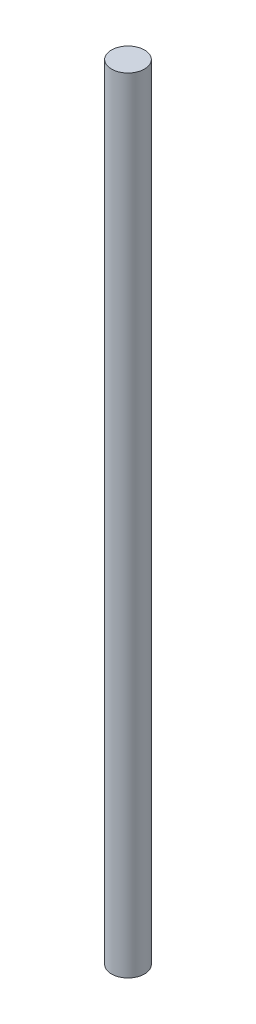
ISO-10303-21;
HEADER;
FILE_DESCRIPTION(('STEP AP214'),'2;1');
FILE_NAME('part.step','',(''),(''),'','','');
FILE_SCHEMA(('AUTOMOTIVE_DESIGN { 1 0 10303 214 1 1 1 1 }'));
ENDSEC;
DATA;
#1=APPLICATION_CONTEXT('core data for automotive mechanical design processes');
#2=APPLICATION_PROTOCOL_DEFINITION('international standard','automotive_design',2000,#1);
#3=PRODUCT_CONTEXT('',#1,'mechanical');
#4=PRODUCT('Part','Part','',(#3));
#5=PRODUCT_RELATED_PRODUCT_CATEGORY('part','',(#4));
#6=PRODUCT_DEFINITION_FORMATION('','',#4);
#7=PRODUCT_DEFINITION_CONTEXT('part definition',#1,'design');
#8=PRODUCT_DEFINITION('design','',#6,#7);
#9=PRODUCT_DEFINITION_SHAPE('','',#8);
#10=(LENGTH_UNIT() NAMED_UNIT(*) SI_UNIT(.MILLI.,.METRE.));
#11=(NAMED_UNIT(*) PLANE_ANGLE_UNIT() SI_UNIT($,.RADIAN.));
#12=(NAMED_UNIT(*) SI_UNIT($,.STERADIAN.) SOLID_ANGLE_UNIT());
#13=UNCERTAINTY_MEASURE_WITH_UNIT(LENGTH_MEASURE(1.E-05),#10,'distance_accuracy_value','');
#14=(GEOMETRIC_REPRESENTATION_CONTEXT(3) GLOBAL_UNCERTAINTY_ASSIGNED_CONTEXT((#13)) GLOBAL_UNIT_ASSIGNED_CONTEXT((#10,
#11,#12)) REPRESENTATION_CONTEXT('',''));
#15=CARTESIAN_POINT('',(0.,0.,0.));
#16=DIRECTION('',(0.,0.,1.));
#17=DIRECTION('',(1.,0.,0.));
#18=AXIS2_PLACEMENT_3D('',#15,#16,#17);
#19=CARTESIAN_POINT('',(0.,69.85,0.));
#20=DIRECTION('',(0.,-1.,0.));
#21=DIRECTION('',(0.,0.,-1.));
#22=AXIS2_PLACEMENT_3D('',#19,#20,#21);
#23=CYLINDRICAL_SURFACE('',#22,1.4732);
#24=CARTESIAN_POINT('',(0.,69.85,0.));
#25=DIRECTION('',(0.,1.,0.));
#26=DIRECTION('',(0.,0.,1.));
#27=AXIS2_PLACEMENT_3D('',#24,#25,#26);
#28=CIRCLE('',#27,1.4732);
#29=CARTESIAN_POINT('',(0.,69.85,1.4732));
#30=VERTEX_POINT('',#29);
#31=EDGE_CURVE('E10',#30,#30,#28,.T.);
#32=ORIENTED_EDGE('',*,*,#31,.F.);
#33=EDGE_LOOP('',(#32));
#34=FACE_BOUND('',#33,.T.);
#35=CARTESIAN_POINT('',(0.,0.,0.));
#36=DIRECTION('',(0.,1.,0.));
#37=DIRECTION('',(0.,0.,1.));
#38=AXIS2_PLACEMENT_3D('',#35,#36,#37);
#39=CIRCLE('',#38,1.4732);
#40=CARTESIAN_POINT('',(0.,0.,1.4732));
#41=VERTEX_POINT('',#40);
#42=EDGE_CURVE('E31',#41,#41,#39,.T.);
#43=ORIENTED_EDGE('',*,*,#42,.T.);
#44=EDGE_LOOP('',(#43));
#45=FACE_BOUND('',#44,.T.);
#46=ADVANCED_FACE('F28',(#34,#45),#23,.T.);
#47=CARTESIAN_POINT('',(0.,69.85,0.));
#48=DIRECTION('',(0.,1.,0.));
#49=DIRECTION('',(0.,0.,1.));
#50=AXIS2_PLACEMENT_3D('',#47,#48,#49);
#51=PLANE('',#50);
#52=ORIENTED_EDGE('',*,*,#31,.T.);
#53=EDGE_LOOP('',(#52));
#54=FACE_BOUND('',#53,.T.);
#55=ADVANCED_FACE('F43',(#54),#51,.T.);
#56=CARTESIAN_POINT('',(0.,0.,0.));
#57=DIRECTION('',(0.,1.,0.));
#58=DIRECTION('',(0.,0.,1.));
#59=AXIS2_PLACEMENT_3D('',#56,#57,#58);
#60=PLANE('',#59);
#61=ORIENTED_EDGE('',*,*,#42,.F.);
#62=EDGE_LOOP('',(#61));
#63=FACE_BOUND('',#62,.T.);
#64=ADVANCED_FACE('F41',(#63),#60,.F.);
#65=CLOSED_SHELL('',(#46,#55,#64));
#66=MANIFOLD_SOLID_BREP('B2',#65);
#67=ADVANCED_BREP_SHAPE_REPRESENTATION('',(#18,#66),#14);
#68=SHAPE_DEFINITION_REPRESENTATION(#9,#67);
ENDSEC;
END-ISO-10303-21;
